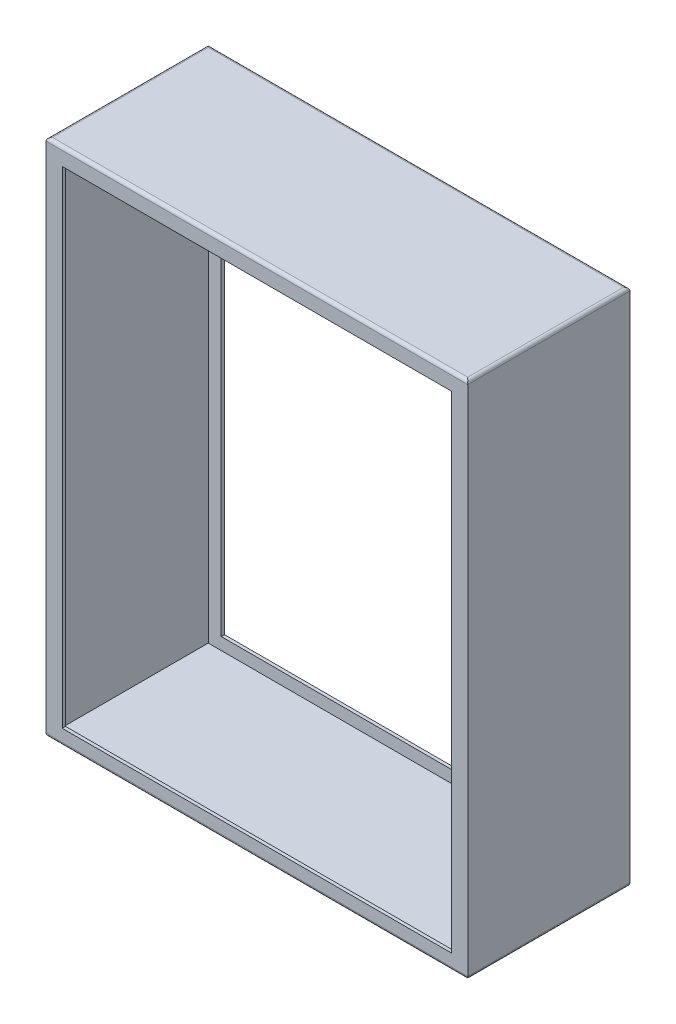
ISO-10303-21;
HEADER;
FILE_DESCRIPTION(('STEP AP214'),'2;1');
FILE_NAME('part.step','',(''),(''),'','','');
FILE_SCHEMA(('AUTOMOTIVE_DESIGN { 1 0 10303 214 1 1 1 1 }'));
ENDSEC;
DATA;
#1=APPLICATION_CONTEXT('core data for automotive mechanical design processes');
#2=APPLICATION_PROTOCOL_DEFINITION('international standard','automotive_design',2000,#1);
#3=PRODUCT_CONTEXT('',#1,'mechanical');
#4=PRODUCT('Part','Part','',(#3));
#5=PRODUCT_RELATED_PRODUCT_CATEGORY('part','',(#4));
#6=PRODUCT_DEFINITION_FORMATION('','',#4);
#7=PRODUCT_DEFINITION_CONTEXT('part definition',#1,'design');
#8=PRODUCT_DEFINITION('design','',#6,#7);
#9=PRODUCT_DEFINITION_SHAPE('','',#8);
#10=(LENGTH_UNIT() NAMED_UNIT(*) SI_UNIT(.MILLI.,.METRE.));
#11=(NAMED_UNIT(*) PLANE_ANGLE_UNIT() SI_UNIT($,.RADIAN.));
#12=(NAMED_UNIT(*) SI_UNIT($,.STERADIAN.) SOLID_ANGLE_UNIT());
#13=UNCERTAINTY_MEASURE_WITH_UNIT(LENGTH_MEASURE(1.E-05),#10,'distance_accuracy_value','');
#14=(GEOMETRIC_REPRESENTATION_CONTEXT(3) GLOBAL_UNCERTAINTY_ASSIGNED_CONTEXT((#13)) GLOBAL_UNIT_ASSIGNED_CONTEXT((#10,
#11,#12)) REPRESENTATION_CONTEXT('',''));
#15=CARTESIAN_POINT('',(0.,0.,0.));
#16=DIRECTION('',(0.,0.,1.));
#17=DIRECTION('',(1.,0.,0.));
#18=AXIS2_PLACEMENT_3D('',#15,#16,#17);
#19=CARTESIAN_POINT('',(317.5,393.065,0.));
#20=DIRECTION('',(1.,0.,0.));
#21=DIRECTION('',(0.,1.,0.));
#22=AXIS2_PLACEMENT_3D('',#19,#20,#21);
#23=PLANE('',#22);
#24=DIRECTION('',(0.,1.,0.));
#25=VECTOR('',#24,1.);
#26=CARTESIAN_POINT('',(317.5,393.065,124.46));
#27=LINE('',#26,#25);
#28=CARTESIAN_POINT('',(317.5,12.0649999999999,124.46));
#29=VERTEX_POINT('',#28);
#30=CARTESIAN_POINT('',(317.5,393.065,124.46));
#31=VERTEX_POINT('',#30);
#32=EDGE_CURVE('E56',#29,#31,#27,.T.);
#33=ORIENTED_EDGE('',*,*,#32,.F.);
#34=DIRECTION('',(0.,0.,1.));
#35=VECTOR('',#34,1.);
#36=CARTESIAN_POINT('',(317.5,12.0649999999999,0.));
#37=LINE('',#36,#35);
#38=CARTESIAN_POINT('',(317.5,12.0649999999999,127.));
#39=VERTEX_POINT('',#38);
#40=EDGE_CURVE('E265',#29,#39,#37,.T.);
#41=ORIENTED_EDGE('',*,*,#40,.T.);
#42=DIRECTION('',(0.,1.,0.));
#43=VECTOR('',#42,1.);
#44=CARTESIAN_POINT('',(317.5,393.065,127.));
#45=LINE('',#44,#43);
#46=CARTESIAN_POINT('',(317.5,393.065,127.));
#47=VERTEX_POINT('',#46);
#48=EDGE_CURVE('E216',#39,#47,#45,.T.);
#49=ORIENTED_EDGE('',*,*,#48,.T.);
#50=DIRECTION('',(0.,0.,1.));
#51=VECTOR('',#50,1.);
#52=CARTESIAN_POINT('',(317.5,393.065,0.));
#53=LINE('',#52,#51);
#54=EDGE_CURVE('E250',#31,#47,#53,.T.);
#55=ORIENTED_EDGE('',*,*,#54,.F.);
#56=EDGE_LOOP('',(#33,#41,#49,#55));
#57=FACE_BOUND('',#56,.T.);
#58=ADVANCED_FACE('F39',(#57),#23,.F.);
#59=CARTESIAN_POINT('',(12.7,12.0649999999999,0.));
#60=DIRECTION('',(0.,-1.,0.));
#61=DIRECTION('',(0.,0.,-1.));
#62=AXIS2_PLACEMENT_3D('',#59,#60,#61);
#63=PLANE('',#62);
#64=DIRECTION('',(1.,0.,0.));
#65=VECTOR('',#64,1.);
#66=CARTESIAN_POINT('',(12.7,12.0649999999999,124.46));
#67=LINE('',#66,#65);
#68=CARTESIAN_POINT('',(12.7,12.0649999999999,124.46));
#69=VERTEX_POINT('',#68);
#70=EDGE_CURVE('E228',#69,#29,#67,.T.);
#71=ORIENTED_EDGE('',*,*,#70,.F.);
#72=DIRECTION('',(0.,0.,1.));
#73=VECTOR('',#72,1.);
#74=CARTESIAN_POINT('',(12.7,12.0649999999999,0.));
#75=LINE('',#74,#73);
#76=CARTESIAN_POINT('',(12.7,12.0649999999999,127.));
#77=VERTEX_POINT('',#76);
#78=EDGE_CURVE('E269',#69,#77,#75,.T.);
#79=ORIENTED_EDGE('',*,*,#78,.T.);
#80=DIRECTION('',(1.,0.,0.));
#81=VECTOR('',#80,1.);
#82=CARTESIAN_POINT('',(12.7,12.0649999999999,127.));
#83=LINE('',#82,#81);
#84=EDGE_CURVE('E241',#77,#39,#83,.T.);
#85=ORIENTED_EDGE('',*,*,#84,.T.);
#86=ORIENTED_EDGE('',*,*,#40,.F.);
#87=EDGE_LOOP('',(#71,#79,#85,#86));
#88=FACE_BOUND('',#87,.T.);
#89=ADVANCED_FACE('F396',(#88),#63,.F.);
#90=CARTESIAN_POINT('',(12.6999999999999,393.065,0.));
#91=DIRECTION('',(-1.,0.,0.));
#92=DIRECTION('',(0.,-1.,0.));
#93=AXIS2_PLACEMENT_3D('',#90,#91,#92);
#94=PLANE('',#93);
#95=DIRECTION('',(0.,-1.,0.));
#96=VECTOR('',#95,1.);
#97=CARTESIAN_POINT('',(12.6999999999999,393.065,124.46));
#98=LINE('',#97,#96);
#99=CARTESIAN_POINT('',(12.6999999999999,393.065,124.46));
#100=VERTEX_POINT('',#99);
#101=EDGE_CURVE('E226',#100,#69,#98,.T.);
#102=ORIENTED_EDGE('',*,*,#101,.F.);
#103=DIRECTION('',(0.,0.,1.));
#104=VECTOR('',#103,1.);
#105=CARTESIAN_POINT('',(12.6999999999999,393.065,0.));
#106=LINE('',#105,#104);
#107=CARTESIAN_POINT('',(12.6999999999999,393.065,127.));
#108=VERTEX_POINT('',#107);
#109=EDGE_CURVE('E273',#100,#108,#106,.T.);
#110=ORIENTED_EDGE('',*,*,#109,.T.);
#111=DIRECTION('',(0.,-1.,0.));
#112=VECTOR('',#111,1.);
#113=CARTESIAN_POINT('',(12.6999999999999,393.065,127.));
#114=LINE('',#113,#112);
#115=EDGE_CURVE('E256',#108,#77,#114,.T.);
#116=ORIENTED_EDGE('',*,*,#115,.T.);
#117=ORIENTED_EDGE('',*,*,#78,.F.);
#118=EDGE_LOOP('',(#102,#110,#116,#117));
#119=FACE_BOUND('',#118,.T.);
#120=ADVANCED_FACE('F403',(#119),#94,.F.);
#121=CARTESIAN_POINT('',(12.6999999999999,393.065,0.));
#122=DIRECTION('',(0.,1.,0.));
#123=DIRECTION('',(0.,0.,1.));
#124=AXIS2_PLACEMENT_3D('',#121,#122,#123);
#125=PLANE('',#124);
#126=DIRECTION('',(-1.,0.,0.));
#127=VECTOR('',#126,1.);
#128=CARTESIAN_POINT('',(12.6999999999999,393.065,124.46));
#129=LINE('',#128,#127);
#130=EDGE_CURVE('E224',#31,#100,#129,.T.);
#131=ORIENTED_EDGE('',*,*,#130,.F.);
#132=ORIENTED_EDGE('',*,*,#54,.T.);
#133=DIRECTION('',(-1.,0.,0.));
#134=VECTOR('',#133,1.);
#135=CARTESIAN_POINT('',(12.6999999999999,393.065,127.));
#136=LINE('',#135,#134);
#137=EDGE_CURVE('E253',#47,#108,#136,.T.);
#138=ORIENTED_EDGE('',*,*,#137,.T.);
#139=ORIENTED_EDGE('',*,*,#109,.F.);
#140=EDGE_LOOP('',(#131,#132,#138,#139));
#141=FACE_BOUND('',#140,.T.);
#142=ADVANCED_FACE('F428',(#141),#125,.F.);
#143=CARTESIAN_POINT('',(0.,0.,127.));
#144=DIRECTION('',(1.,0.,0.));
#145=DIRECTION('',(0.,0.,-1.));
#146=AXIS2_PLACEMENT_3D('',#143,#144,#145);
#147=PLANE('',#146);
#148=DIRECTION('',(0.,-1.,0.));
#149=VECTOR('',#148,1.);
#150=CARTESIAN_POINT('',(0.,0.,0.));
#151=LINE('',#150,#149);
#152=CARTESIAN_POINT('',(0.,403.86,0.));
#153=VERTEX_POINT('',#152);
#154=CARTESIAN_POINT('',(0.,2.54,0.));
#155=VERTEX_POINT('',#154);
#156=EDGE_CURVE('E284',#153,#155,#151,.T.);
#157=ORIENTED_EDGE('',*,*,#156,.T.);
#158=DIRECTION('',(0.,0.,-1.));
#159=VECTOR('',#158,1.);
#160=CARTESIAN_POINT('',(0.,2.54,127.));
#161=LINE('',#160,#159);
#162=CARTESIAN_POINT('',(0.,2.54,127.));
#163=VERTEX_POINT('',#162);
#164=EDGE_CURVE('E326',#155,#163,#161,.F.);
#165=ORIENTED_EDGE('',*,*,#164,.T.);
#166=DIRECTION('',(0.,-1.,0.));
#167=VECTOR('',#166,1.);
#168=CARTESIAN_POINT('',(0.,0.,127.));
#169=LINE('',#168,#167);
#170=CARTESIAN_POINT('',(0.,403.86,127.));
#171=VERTEX_POINT('',#170);
#172=EDGE_CURVE('E277',#171,#163,#169,.T.);
#173=ORIENTED_EDGE('',*,*,#172,.F.);
#174=DIRECTION('',(0.,0.,-1.));
#175=VECTOR('',#174,1.);
#176=CARTESIAN_POINT('',(0.,403.86,127.));
#177=LINE('',#176,#175);
#178=EDGE_CURVE('E302',#171,#153,#177,.T.);
#179=ORIENTED_EDGE('',*,*,#178,.T.);
#180=EDGE_LOOP('',(#157,#165,#173,#179));
#181=FACE_BOUND('',#180,.T.);
#182=ADVANCED_FACE('F381',(#181),#147,.F.);
#183=CARTESIAN_POINT('',(0.,0.,127.));
#184=DIRECTION('',(0.,1.,0.));
#185=DIRECTION('',(0.,0.,1.));
#186=AXIS2_PLACEMENT_3D('',#183,#184,#185);
#187=PLANE('',#186);
#188=DIRECTION('',(1.,0.,0.));
#189=VECTOR('',#188,1.);
#190=CARTESIAN_POINT('',(0.,0.,124.46));
#191=LINE('',#190,#189);
#192=CARTESIAN_POINT('',(327.66,0.,124.46));
#193=VERTEX_POINT('',#192);
#194=CARTESIAN_POINT('',(2.54,0.,124.46));
#195=VERTEX_POINT('',#194);
#196=EDGE_CURVE('E321',#193,#195,#191,.F.);
#197=ORIENTED_EDGE('',*,*,#196,.T.);
#198=DIRECTION('',(0.,0.,-1.));
#199=VECTOR('',#198,1.);
#200=CARTESIAN_POINT('',(2.54,0.,127.));
#201=LINE('',#200,#199);
#202=CARTESIAN_POINT('',(2.54,0.,2.54));
#203=VERTEX_POINT('',#202);
#204=EDGE_CURVE('E323',#195,#203,#201,.T.);
#205=ORIENTED_EDGE('',*,*,#204,.T.);
#206=DIRECTION('',(1.,0.,0.));
#207=VECTOR('',#206,1.);
#208=CARTESIAN_POINT('',(330.2,0.,2.54));
#209=LINE('',#208,#207);
#210=CARTESIAN_POINT('',(327.66,0.,2.54));
#211=VERTEX_POINT('',#210);
#212=EDGE_CURVE('E307',#203,#211,#209,.T.);
#213=ORIENTED_EDGE('',*,*,#212,.T.);
#214=DIRECTION('',(0.,0.,-1.));
#215=VECTOR('',#214,1.);
#216=CARTESIAN_POINT('',(327.66,0.,127.));
#217=LINE('',#216,#215);
#218=EDGE_CURVE('E319',#211,#193,#217,.F.);
#219=ORIENTED_EDGE('',*,*,#218,.T.);
#220=EDGE_LOOP('',(#197,#205,#213,#219));
#221=FACE_BOUND('',#220,.T.);
#222=ADVANCED_FACE('F441',(#221),#187,.F.);
#223=CARTESIAN_POINT('',(330.2,0.,127.));
#224=DIRECTION('',(-1.,0.,0.));
#225=DIRECTION('',(0.,0.,1.));
#226=AXIS2_PLACEMENT_3D('',#223,#224,#225);
#227=PLANE('',#226);
#228=DIRECTION('',(0.,1.,0.));
#229=VECTOR('',#228,1.);
#230=CARTESIAN_POINT('',(330.2,0.,127.));
#231=LINE('',#230,#229);
#232=CARTESIAN_POINT('',(330.2,2.54,127.));
#233=VERTEX_POINT('',#232);
#234=CARTESIAN_POINT('',(330.2,403.86,127.));
#235=VERTEX_POINT('',#234);
#236=EDGE_CURVE('E280',#233,#235,#231,.T.);
#237=ORIENTED_EDGE('',*,*,#236,.F.);
#238=DIRECTION('',(0.,0.,-1.));
#239=VECTOR('',#238,1.);
#240=CARTESIAN_POINT('',(330.2,2.54,127.));
#241=LINE('',#240,#239);
#242=CARTESIAN_POINT('',(330.2,2.54,0.));
#243=VERTEX_POINT('',#242);
#244=EDGE_CURVE('E48',#233,#243,#241,.T.);
#245=ORIENTED_EDGE('',*,*,#244,.T.);
#246=DIRECTION('',(0.,1.,0.));
#247=VECTOR('',#246,1.);
#248=CARTESIAN_POINT('',(330.2,0.,0.));
#249=LINE('',#248,#247);
#250=CARTESIAN_POINT('',(330.2,403.86,0.));
#251=VERTEX_POINT('',#250);
#252=EDGE_CURVE('E281',#243,#251,#249,.T.);
#253=ORIENTED_EDGE('',*,*,#252,.T.);
#254=DIRECTION('',(0.,0.,-1.));
#255=VECTOR('',#254,1.);
#256=CARTESIAN_POINT('',(330.2,403.86,127.));
#257=LINE('',#256,#255);
#258=EDGE_CURVE('E297',#251,#235,#257,.F.);
#259=ORIENTED_EDGE('',*,*,#258,.T.);
#260=EDGE_LOOP('',(#237,#245,#253,#259));
#261=FACE_BOUND('',#260,.T.);
#262=ADVANCED_FACE('F353',(#261),#227,.F.);
#263=CARTESIAN_POINT('',(0.,406.4,127.));
#264=DIRECTION('',(0.,-1.,0.));
#265=DIRECTION('',(0.,0.,-1.));
#266=AXIS2_PLACEMENT_3D('',#263,#264,#265);
#267=PLANE('',#266);
#268=DIRECTION('',(-1.,0.,0.));
#269=VECTOR('',#268,1.);
#270=CARTESIAN_POINT('',(0.,406.4,124.46));
#271=LINE('',#270,#269);
#272=CARTESIAN_POINT('',(2.54,406.4,124.46));
#273=VERTEX_POINT('',#272);
#274=CARTESIAN_POINT('',(327.66,406.4,124.46));
#275=VERTEX_POINT('',#274);
#276=EDGE_CURVE('E292',#273,#275,#271,.F.);
#277=ORIENTED_EDGE('',*,*,#276,.T.);
#278=DIRECTION('',(0.,0.,-1.));
#279=VECTOR('',#278,1.);
#280=CARTESIAN_POINT('',(327.66,406.4,127.));
#281=LINE('',#280,#279);
#282=CARTESIAN_POINT('',(327.66,406.4,2.54));
#283=VERTEX_POINT('',#282);
#284=EDGE_CURVE('E294',#275,#283,#281,.T.);
#285=ORIENTED_EDGE('',*,*,#284,.T.);
#286=DIRECTION('',(-1.,0.,0.));
#287=VECTOR('',#286,1.);
#288=CARTESIAN_POINT('',(0.,406.4,2.54));
#289=LINE('',#288,#287);
#290=CARTESIAN_POINT('',(2.54,406.4,2.54));
#291=VERTEX_POINT('',#290);
#292=EDGE_CURVE('E283',#283,#291,#289,.T.);
#293=ORIENTED_EDGE('',*,*,#292,.T.);
#294=DIRECTION('',(0.,0.,-1.));
#295=VECTOR('',#294,1.);
#296=CARTESIAN_POINT('',(2.54,406.4,127.));
#297=LINE('',#296,#295);
#298=EDGE_CURVE('E290',#291,#273,#297,.F.);
#299=ORIENTED_EDGE('',*,*,#298,.T.);
#300=EDGE_LOOP('',(#277,#285,#293,#299));
#301=FACE_BOUND('',#300,.T.);
#302=ADVANCED_FACE('F371',(#301),#267,.F.);
#303=CARTESIAN_POINT('',(0.,0.,127.));
#304=DIRECTION('',(0.,0.,-1.));
#305=DIRECTION('',(-1.,0.,0.));
#306=AXIS2_PLACEMENT_3D('',#303,#304,#305);
#307=PLANE('',#306);
#308=ORIENTED_EDGE('',*,*,#137,.F.);
#309=ORIENTED_EDGE('',*,*,#48,.F.);
#310=ORIENTED_EDGE('',*,*,#84,.F.);
#311=ORIENTED_EDGE('',*,*,#115,.F.);
#312=EDGE_LOOP('',(#308,#309,#310,#311));
#313=FACE_BOUND('',#312,.T.);
#314=ORIENTED_EDGE('',*,*,#172,.T.);
#315=DIRECTION('',(1.,0.,0.));
#316=VECTOR('',#315,1.);
#317=CARTESIAN_POINT('',(0.,2.54,127.));
#318=LINE('',#317,#316);
#319=EDGE_CURVE('E329',#163,#233,#318,.T.);
#320=ORIENTED_EDGE('',*,*,#319,.T.);
#321=ORIENTED_EDGE('',*,*,#236,.T.);
#322=DIRECTION('',(-1.,0.,0.));
#323=VECTOR('',#322,1.);
#324=CARTESIAN_POINT('',(0.,403.86,127.));
#325=LINE('',#324,#323);
#326=EDGE_CURVE('E300',#235,#171,#325,.T.);
#327=ORIENTED_EDGE('',*,*,#326,.T.);
#328=EDGE_LOOP('',(#314,#320,#321,#327));
#329=FACE_BOUND('',#328,.T.);
#330=ADVANCED_FACE('F378',(#313,#329),#307,.F.);
#331=CARTESIAN_POINT('',(0.,0.,0.));
#332=DIRECTION('',(0.,0.,-1.));
#333=DIRECTION('',(-1.,0.,0.));
#334=AXIS2_PLACEMENT_3D('',#331,#332,#333);
#335=PLANE('',#334);
#336=DIRECTION('',(0.,1.,0.));
#337=VECTOR('',#336,1.);
#338=CARTESIAN_POINT('',(317.5,393.065,0.));
#339=LINE('',#338,#337);
#340=CARTESIAN_POINT('',(317.5,12.0649999999999,0.));
#341=VERTEX_POINT('',#340);
#342=CARTESIAN_POINT('',(317.5,393.065,0.));
#343=VERTEX_POINT('',#342);
#344=EDGE_CURVE('E237',#341,#343,#339,.T.);
#345=ORIENTED_EDGE('',*,*,#344,.T.);
#346=DIRECTION('',(-1.,0.,0.));
#347=VECTOR('',#346,1.);
#348=CARTESIAN_POINT('',(12.6999999999999,393.065,0.));
#349=LINE('',#348,#347);
#350=CARTESIAN_POINT('',(12.6999999999999,393.065,0.));
#351=VERTEX_POINT('',#350);
#352=EDGE_CURVE('E240',#343,#351,#349,.T.);
#353=ORIENTED_EDGE('',*,*,#352,.T.);
#354=DIRECTION('',(0.,-1.,0.));
#355=VECTOR('',#354,1.);
#356=CARTESIAN_POINT('',(12.6999999999999,393.065,0.));
#357=LINE('',#356,#355);
#358=CARTESIAN_POINT('',(12.7,12.0649999999999,0.));
#359=VERTEX_POINT('',#358);
#360=EDGE_CURVE('E244',#351,#359,#357,.T.);
#361=ORIENTED_EDGE('',*,*,#360,.T.);
#362=DIRECTION('',(1.,0.,0.));
#363=VECTOR('',#362,1.);
#364=CARTESIAN_POINT('',(12.7,12.0649999999999,0.));
#365=LINE('',#364,#363);
#366=EDGE_CURVE('E247',#359,#341,#365,.T.);
#367=ORIENTED_EDGE('',*,*,#366,.T.);
#368=EDGE_LOOP('',(#345,#353,#361,#367));
#369=FACE_BOUND('',#368,.T.);
#370=ORIENTED_EDGE('',*,*,#252,.F.);
#371=DIRECTION('',(1.,0.,0.));
#372=VECTOR('',#371,1.);
#373=CARTESIAN_POINT('',(0.,2.54,0.));
#374=LINE('',#373,#372);
#375=EDGE_CURVE('E11',#243,#155,#374,.F.);
#376=ORIENTED_EDGE('',*,*,#375,.T.);
#377=ORIENTED_EDGE('',*,*,#156,.F.);
#378=DIRECTION('',(-1.,0.,0.));
#379=VECTOR('',#378,1.);
#380=CARTESIAN_POINT('',(330.2,403.86,0.));
#381=LINE('',#380,#379);
#382=EDGE_CURVE('E304',#153,#251,#381,.F.);
#383=ORIENTED_EDGE('',*,*,#382,.T.);
#384=EDGE_LOOP('',(#370,#376,#377,#383));
#385=FACE_BOUND('',#384,.T.);
#386=ADVANCED_FACE('F355',(#369,#385),#335,.T.);
#387=CARTESIAN_POINT('',(2.54,403.86,127.));
#388=DIRECTION('',(0.,0.,-1.));
#389=DIRECTION('',(-1.,0.,0.));
#390=AXIS2_PLACEMENT_3D('',#387,#388,#389);
#391=CYLINDRICAL_SURFACE('',#390,2.54);
#392=CARTESIAN_POINT('',(2.54,403.86,2.54));
#393=DIRECTION('',(0.707106781186547,0.,-0.707106781186547));
#394=DIRECTION('',(0.707106781186547,0.,0.707106781186547));
#395=AXIS2_PLACEMENT_3D('',#392,#393,#394);
#396=ELLIPSE('',#395,3.59210244842766,2.54);
#397=EDGE_CURVE('E313',#153,#291,#396,.T.);
#398=ORIENTED_EDGE('',*,*,#397,.F.);
#399=ORIENTED_EDGE('',*,*,#178,.F.);
#400=CARTESIAN_POINT('',(2.54,403.86,124.46));
#401=DIRECTION('',(-0.707106781186547,0.,-0.707106781186547));
#402=DIRECTION('',(0.707106781186547,0.,-0.707106781186547));
#403=AXIS2_PLACEMENT_3D('',#400,#401,#402);
#404=ELLIPSE('',#403,3.59210244842766,2.54);
#405=EDGE_CURVE('E287',#273,#171,#404,.F.);
#406=ORIENTED_EDGE('',*,*,#405,.F.);
#407=ORIENTED_EDGE('',*,*,#298,.F.);
#408=EDGE_LOOP('',(#398,#399,#406,#407));
#409=FACE_BOUND('',#408,.T.);
#410=ADVANCED_FACE('F384',(#409),#391,.T.);
#411=CARTESIAN_POINT('',(0.,403.86,124.46));
#412=DIRECTION('',(-1.,0.,0.));
#413=DIRECTION('',(0.,0.,1.));
#414=AXIS2_PLACEMENT_3D('',#411,#412,#413);
#415=CYLINDRICAL_SURFACE('',#414,2.54);
#416=ORIENTED_EDGE('',*,*,#405,.T.);
#417=ORIENTED_EDGE('',*,*,#326,.F.);
#418=CARTESIAN_POINT('',(327.66,403.86,124.46));
#419=DIRECTION('',(-0.707106781186547,0.,0.707106781186547));
#420=DIRECTION('',(-0.707106781186547,0.,-0.707106781186547));
#421=AXIS2_PLACEMENT_3D('',#418,#419,#420);
#422=ELLIPSE('',#421,3.59210244842766,2.54);
#423=EDGE_CURVE('E310',#275,#235,#422,.F.);
#424=ORIENTED_EDGE('',*,*,#423,.F.);
#425=ORIENTED_EDGE('',*,*,#276,.F.);
#426=EDGE_LOOP('',(#416,#417,#424,#425));
#427=FACE_BOUND('',#426,.T.);
#428=ADVANCED_FACE('F375',(#427),#415,.T.);
#429=CARTESIAN_POINT('',(0.,403.86,2.54));
#430=DIRECTION('',(1.,0.,0.));
#431=DIRECTION('',(0.,0.,-1.));
#432=AXIS2_PLACEMENT_3D('',#429,#430,#431);
#433=CYLINDRICAL_SURFACE('',#432,2.54);
#434=ORIENTED_EDGE('',*,*,#397,.T.);
#435=ORIENTED_EDGE('',*,*,#292,.F.);
#436=CARTESIAN_POINT('',(327.66,403.86,2.54));
#437=DIRECTION('',(0.707106781186547,0.,0.707106781186547));
#438=DIRECTION('',(0.707106781186547,0.,-0.707106781186547));
#439=AXIS2_PLACEMENT_3D('',#436,#437,#438);
#440=ELLIPSE('',#439,3.59210244842766,2.54);
#441=EDGE_CURVE('E308',#251,#283,#440,.T.);
#442=ORIENTED_EDGE('',*,*,#441,.F.);
#443=ORIENTED_EDGE('',*,*,#382,.F.);
#444=EDGE_LOOP('',(#434,#435,#442,#443));
#445=FACE_BOUND('',#444,.T.);
#446=ADVANCED_FACE('F368',(#445),#433,.T.);
#447=CARTESIAN_POINT('',(327.66,403.86,127.));
#448=DIRECTION('',(0.,0.,-1.));
#449=DIRECTION('',(-1.,0.,0.));
#450=AXIS2_PLACEMENT_3D('',#447,#448,#449);
#451=CYLINDRICAL_SURFACE('',#450,2.54);
#452=ORIENTED_EDGE('',*,*,#423,.T.);
#453=ORIENTED_EDGE('',*,*,#258,.F.);
#454=ORIENTED_EDGE('',*,*,#441,.T.);
#455=ORIENTED_EDGE('',*,*,#284,.F.);
#456=EDGE_LOOP('',(#452,#453,#454,#455));
#457=FACE_BOUND('',#456,.T.);
#458=ADVANCED_FACE('F363',(#457),#451,.T.);
#459=CARTESIAN_POINT('',(327.66,2.54,127.));
#460=DIRECTION('',(0.,0.,-1.));
#461=DIRECTION('',(-1.,0.,0.));
#462=AXIS2_PLACEMENT_3D('',#459,#460,#461);
#463=CYLINDRICAL_SURFACE('',#462,2.54);
#464=CARTESIAN_POINT('',(327.66,2.54,2.54));
#465=DIRECTION('',(-0.707106781186547,0.,-0.707106781186547));
#466=DIRECTION('',(-0.707106781186547,0.,0.707106781186547));
#467=AXIS2_PLACEMENT_3D('',#464,#465,#466);
#468=ELLIPSE('',#467,3.59210244842766,2.54);
#469=EDGE_CURVE('E334',#243,#211,#468,.T.);
#470=ORIENTED_EDGE('',*,*,#469,.F.);
#471=ORIENTED_EDGE('',*,*,#244,.F.);
#472=CARTESIAN_POINT('',(327.66,2.54,124.46));
#473=DIRECTION('',(0.707106781186547,0.,-0.707106781186547));
#474=DIRECTION('',(-0.707106781186547,0.,-0.707106781186547));
#475=AXIS2_PLACEMENT_3D('',#472,#473,#474);
#476=ELLIPSE('',#475,3.59210244842766,2.54);
#477=EDGE_CURVE('E43',#193,#233,#476,.F.);
#478=ORIENTED_EDGE('',*,*,#477,.F.);
#479=ORIENTED_EDGE('',*,*,#218,.F.);
#480=EDGE_LOOP('',(#470,#471,#478,#479));
#481=FACE_BOUND('',#480,.T.);
#482=ADVANCED_FACE('F41',(#481),#463,.T.);
#483=CARTESIAN_POINT('',(0.,2.54,124.46));
#484=DIRECTION('',(1.,0.,0.));
#485=DIRECTION('',(0.,0.,-1.));
#486=AXIS2_PLACEMENT_3D('',#483,#484,#485);
#487=CYLINDRICAL_SURFACE('',#486,2.54);
#488=ORIENTED_EDGE('',*,*,#477,.T.);
#489=ORIENTED_EDGE('',*,*,#319,.F.);
#490=CARTESIAN_POINT('',(2.54,2.54,124.46));
#491=DIRECTION('',(0.707106781186547,0.,0.707106781186547));
#492=DIRECTION('',(0.707106781186547,0.,-0.707106781186547));
#493=AXIS2_PLACEMENT_3D('',#490,#491,#492);
#494=ELLIPSE('',#493,3.59210244842766,2.54);
#495=EDGE_CURVE('E333',#195,#163,#494,.F.);
#496=ORIENTED_EDGE('',*,*,#495,.F.);
#497=ORIENTED_EDGE('',*,*,#196,.F.);
#498=EDGE_LOOP('',(#488,#489,#496,#497));
#499=FACE_BOUND('',#498,.T.);
#500=ADVANCED_FACE('F345',(#499),#487,.T.);
#501=CARTESIAN_POINT('',(0.,2.54,2.54));
#502=DIRECTION('',(-1.,0.,0.));
#503=DIRECTION('',(0.,0.,1.));
#504=AXIS2_PLACEMENT_3D('',#501,#502,#503);
#505=CYLINDRICAL_SURFACE('',#504,2.54);
#506=ORIENTED_EDGE('',*,*,#469,.T.);
#507=ORIENTED_EDGE('',*,*,#212,.F.);
#508=CARTESIAN_POINT('',(2.54,2.54,2.54));
#509=DIRECTION('',(-0.707106781186547,0.,0.707106781186547));
#510=DIRECTION('',(-0.707106781186547,0.,-0.707106781186547));
#511=AXIS2_PLACEMENT_3D('',#508,#509,#510);
#512=ELLIPSE('',#511,3.59210244842766,2.54);
#513=EDGE_CURVE('E264',#155,#203,#512,.T.);
#514=ORIENTED_EDGE('',*,*,#513,.F.);
#515=ORIENTED_EDGE('',*,*,#375,.F.);
#516=EDGE_LOOP('',(#506,#507,#514,#515));
#517=FACE_BOUND('',#516,.T.);
#518=ADVANCED_FACE('F418',(#517),#505,.T.);
#519=CARTESIAN_POINT('',(2.54,2.54,127.));
#520=DIRECTION('',(0.,0.,-1.));
#521=DIRECTION('',(-1.,0.,0.));
#522=AXIS2_PLACEMENT_3D('',#519,#520,#521);
#523=CYLINDRICAL_SURFACE('',#522,2.54);
#524=ORIENTED_EDGE('',*,*,#495,.T.);
#525=ORIENTED_EDGE('',*,*,#164,.F.);
#526=ORIENTED_EDGE('',*,*,#513,.T.);
#527=ORIENTED_EDGE('',*,*,#204,.F.);
#528=EDGE_LOOP('',(#524,#525,#526,#527));
#529=FACE_BOUND('',#528,.T.);
#530=ADVANCED_FACE('F410',(#529),#523,.T.);
#531=CARTESIAN_POINT('',(317.5,12.0649999999999,2.54));
#532=VERTEX_POINT('',#531);
#533=EDGE_CURVE('E261',#341,#532,#37,.T.);
#534=ORIENTED_EDGE('',*,*,#533,.T.);
#535=DIRECTION('',(0.,1.,0.));
#536=VECTOR('',#535,1.);
#537=CARTESIAN_POINT('',(317.5,393.065,2.54));
#538=LINE('',#537,#536);
#539=CARTESIAN_POINT('',(317.5,393.065,2.54));
#540=VERTEX_POINT('',#539);
#541=EDGE_CURVE('E230',#532,#540,#538,.T.);
#542=ORIENTED_EDGE('',*,*,#541,.T.);
#543=EDGE_CURVE('E274',#343,#540,#53,.T.);
#544=ORIENTED_EDGE('',*,*,#543,.F.);
#545=ORIENTED_EDGE('',*,*,#344,.F.);
#546=EDGE_LOOP('',(#534,#542,#544,#545));
#547=FACE_BOUND('',#546,.T.);
#548=ADVANCED_FACE('F399',(#547),#23,.F.);
#549=CARTESIAN_POINT('',(12.7,12.0649999999999,2.54));
#550=VERTEX_POINT('',#549);
#551=EDGE_CURVE('E266',#359,#550,#75,.T.);
#552=ORIENTED_EDGE('',*,*,#551,.T.);
#553=DIRECTION('',(1.,0.,0.));
#554=VECTOR('',#553,1.);
#555=CARTESIAN_POINT('',(12.7,12.0649999999999,2.54));
#556=LINE('',#555,#554);
#557=EDGE_CURVE('E204',#550,#532,#556,.T.);
#558=ORIENTED_EDGE('',*,*,#557,.T.);
#559=ORIENTED_EDGE('',*,*,#533,.F.);
#560=ORIENTED_EDGE('',*,*,#366,.F.);
#561=EDGE_LOOP('',(#552,#558,#559,#560));
#562=FACE_BOUND('',#561,.T.);
#563=ADVANCED_FACE('F406',(#562),#63,.F.);
#564=CARTESIAN_POINT('',(12.6999999999999,393.065,2.54));
#565=VERTEX_POINT('',#564);
#566=EDGE_CURVE('E270',#351,#565,#106,.T.);
#567=ORIENTED_EDGE('',*,*,#566,.T.);
#568=DIRECTION('',(0.,-1.,0.));
#569=VECTOR('',#568,1.);
#570=CARTESIAN_POINT('',(12.6999999999999,393.065,2.54));
#571=LINE('',#570,#569);
#572=EDGE_CURVE('E64',#565,#550,#571,.T.);
#573=ORIENTED_EDGE('',*,*,#572,.T.);
#574=ORIENTED_EDGE('',*,*,#551,.F.);
#575=ORIENTED_EDGE('',*,*,#360,.F.);
#576=EDGE_LOOP('',(#567,#573,#574,#575));
#577=FACE_BOUND('',#576,.T.);
#578=ADVANCED_FACE('F416',(#577),#94,.F.);
#579=ORIENTED_EDGE('',*,*,#543,.T.);
#580=DIRECTION('',(-1.,0.,0.));
#581=VECTOR('',#580,1.);
#582=CARTESIAN_POINT('',(12.6999999999999,393.065,2.54));
#583=LINE('',#582,#581);
#584=EDGE_CURVE('E233',#540,#565,#583,.T.);
#585=ORIENTED_EDGE('',*,*,#584,.T.);
#586=ORIENTED_EDGE('',*,*,#566,.F.);
#587=ORIENTED_EDGE('',*,*,#352,.F.);
#588=EDGE_LOOP('',(#579,#585,#586,#587));
#589=FACE_BOUND('',#588,.T.);
#590=ADVANCED_FACE('F426',(#589),#125,.F.);
#591=CARTESIAN_POINT('',(2.54,0.,127.));
#592=DIRECTION('',(1.,0.,0.));
#593=DIRECTION('',(0.,0.,-1.));
#594=AXIS2_PLACEMENT_3D('',#591,#592,#593);
#595=PLANE('',#594);
#596=DIRECTION('',(0.,-1.,0.));
#597=VECTOR('',#596,1.);
#598=CARTESIAN_POINT('',(2.54,0.,2.54));
#599=LINE('',#598,#597);
#600=CARTESIAN_POINT('',(2.54,403.86,2.54));
#601=VERTEX_POINT('',#600);
#602=CARTESIAN_POINT('',(2.54,2.54,2.54));
#603=VERTEX_POINT('',#602);
#604=EDGE_CURVE('E182',#601,#603,#599,.T.);
#605=ORIENTED_EDGE('',*,*,#604,.F.);
#606=DIRECTION('',(0.,0.,-1.));
#607=VECTOR('',#606,1.);
#608=CARTESIAN_POINT('',(2.54,403.86,127.));
#609=LINE('',#608,#607);
#610=CARTESIAN_POINT('',(2.54,403.86,124.46));
#611=VERTEX_POINT('',#610);
#612=EDGE_CURVE('E197',#611,#601,#609,.T.);
#613=ORIENTED_EDGE('',*,*,#612,.F.);
#614=DIRECTION('',(0.,-1.,0.));
#615=VECTOR('',#614,1.);
#616=CARTESIAN_POINT('',(2.54,0.,124.46));
#617=LINE('',#616,#615);
#618=CARTESIAN_POINT('',(2.54,2.54,124.46));
#619=VERTEX_POINT('',#618);
#620=EDGE_CURVE('E183',#611,#619,#617,.T.);
#621=ORIENTED_EDGE('',*,*,#620,.T.);
#622=DIRECTION('',(0.,0.,1.));
#623=VECTOR('',#622,1.);
#624=CARTESIAN_POINT('',(2.54,2.54,127.));
#625=LINE('',#624,#623);
#626=EDGE_CURVE('E177',#603,#619,#625,.T.);
#627=ORIENTED_EDGE('',*,*,#626,.F.);
#628=EDGE_LOOP('',(#605,#613,#621,#627));
#629=FACE_BOUND('',#628,.T.);
#630=ADVANCED_FACE('F179',(#629),#595,.T.);
#631=CARTESIAN_POINT('',(0.,2.54,127.));
#632=DIRECTION('',(0.,1.,0.));
#633=DIRECTION('',(0.,0.,1.));
#634=AXIS2_PLACEMENT_3D('',#631,#632,#633);
#635=PLANE('',#634);
#636=DIRECTION('',(1.,0.,0.));
#637=VECTOR('',#636,1.);
#638=CARTESIAN_POINT('',(0.,2.54,124.46));
#639=LINE('',#638,#637);
#640=CARTESIAN_POINT('',(327.66,2.54,124.46));
#641=VERTEX_POINT('',#640);
#642=EDGE_CURVE('E187',#619,#641,#639,.T.);
#643=ORIENTED_EDGE('',*,*,#642,.T.);
#644=DIRECTION('',(0.,0.,-1.));
#645=VECTOR('',#644,1.);
#646=CARTESIAN_POINT('',(327.66,2.54,127.));
#647=LINE('',#646,#645);
#648=CARTESIAN_POINT('',(327.66,2.54,2.54));
#649=VERTEX_POINT('',#648);
#650=EDGE_CURVE('E193',#641,#649,#647,.T.);
#651=ORIENTED_EDGE('',*,*,#650,.T.);
#652=DIRECTION('',(1.,0.,0.));
#653=VECTOR('',#652,1.);
#654=CARTESIAN_POINT('',(0.,2.54,2.54));
#655=LINE('',#654,#653);
#656=EDGE_CURVE('E188',#603,#649,#655,.T.);
#657=ORIENTED_EDGE('',*,*,#656,.F.);
#658=ORIENTED_EDGE('',*,*,#626,.T.);
#659=EDGE_LOOP('',(#643,#651,#657,#658));
#660=FACE_BOUND('',#659,.T.);
#661=ADVANCED_FACE('F191',(#660),#635,.T.);
#662=CARTESIAN_POINT('',(327.66,0.,127.));
#663=DIRECTION('',(-1.,0.,0.));
#664=DIRECTION('',(0.,0.,1.));
#665=AXIS2_PLACEMENT_3D('',#662,#663,#664);
#666=PLANE('',#665);
#667=DIRECTION('',(0.,1.,0.));
#668=VECTOR('',#667,1.);
#669=CARTESIAN_POINT('',(327.66,0.,124.46));
#670=LINE('',#669,#668);
#671=CARTESIAN_POINT('',(327.66,403.86,124.46));
#672=VERTEX_POINT('',#671);
#673=EDGE_CURVE('E211',#641,#672,#670,.T.);
#674=ORIENTED_EDGE('',*,*,#673,.T.);
#675=DIRECTION('',(0.,0.,1.));
#676=VECTOR('',#675,1.);
#677=CARTESIAN_POINT('',(327.66,403.86,127.));
#678=LINE('',#677,#676);
#679=CARTESIAN_POINT('',(327.66,403.86,2.54));
#680=VERTEX_POINT('',#679);
#681=EDGE_CURVE('E219',#680,#672,#678,.T.);
#682=ORIENTED_EDGE('',*,*,#681,.F.);
#683=DIRECTION('',(0.,1.,0.));
#684=VECTOR('',#683,1.);
#685=CARTESIAN_POINT('',(327.66,0.,2.54));
#686=LINE('',#685,#684);
#687=EDGE_CURVE('E203',#649,#680,#686,.T.);
#688=ORIENTED_EDGE('',*,*,#687,.F.);
#689=ORIENTED_EDGE('',*,*,#650,.F.);
#690=EDGE_LOOP('',(#674,#682,#688,#689));
#691=FACE_BOUND('',#690,.T.);
#692=ADVANCED_FACE('F463',(#691),#666,.T.);
#693=CARTESIAN_POINT('',(0.,403.86,127.));
#694=DIRECTION('',(0.,-1.,0.));
#695=DIRECTION('',(0.,0.,-1.));
#696=AXIS2_PLACEMENT_3D('',#693,#694,#695);
#697=PLANE('',#696);
#698=DIRECTION('',(-1.,0.,0.));
#699=VECTOR('',#698,1.);
#700=CARTESIAN_POINT('',(0.,403.86,124.46));
#701=LINE('',#700,#699);
#702=EDGE_CURVE('E213',#672,#611,#701,.T.);
#703=ORIENTED_EDGE('',*,*,#702,.T.);
#704=ORIENTED_EDGE('',*,*,#612,.T.);
#705=DIRECTION('',(-1.,0.,0.));
#706=VECTOR('',#705,1.);
#707=CARTESIAN_POINT('',(0.,403.86,2.54));
#708=LINE('',#707,#706);
#709=EDGE_CURVE('E201',#680,#601,#708,.T.);
#710=ORIENTED_EDGE('',*,*,#709,.F.);
#711=ORIENTED_EDGE('',*,*,#681,.T.);
#712=EDGE_LOOP('',(#703,#704,#710,#711));
#713=FACE_BOUND('',#712,.T.);
#714=ADVANCED_FACE('F458',(#713),#697,.T.);
#715=CARTESIAN_POINT('',(0.,0.,124.46));
#716=DIRECTION('',(0.,0.,-1.));
#717=DIRECTION('',(-1.,0.,0.));
#718=AXIS2_PLACEMENT_3D('',#715,#716,#717);
#719=PLANE('',#718);
#720=ORIENTED_EDGE('',*,*,#130,.T.);
#721=ORIENTED_EDGE('',*,*,#101,.T.);
#722=ORIENTED_EDGE('',*,*,#70,.T.);
#723=ORIENTED_EDGE('',*,*,#32,.T.);
#724=EDGE_LOOP('',(#720,#721,#722,#723));
#725=FACE_BOUND('',#724,.T.);
#726=ORIENTED_EDGE('',*,*,#620,.F.);
#727=ORIENTED_EDGE('',*,*,#702,.F.);
#728=ORIENTED_EDGE('',*,*,#673,.F.);
#729=ORIENTED_EDGE('',*,*,#642,.F.);
#730=EDGE_LOOP('',(#726,#727,#728,#729));
#731=FACE_BOUND('',#730,.T.);
#732=ADVANCED_FACE('F455',(#725,#731),#719,.T.);
#733=CARTESIAN_POINT('',(0.,0.,2.54));
#734=DIRECTION('',(0.,0.,-1.));
#735=DIRECTION('',(-1.,0.,0.));
#736=AXIS2_PLACEMENT_3D('',#733,#734,#735);
#737=PLANE('',#736);
#738=ORIENTED_EDGE('',*,*,#541,.F.);
#739=ORIENTED_EDGE('',*,*,#557,.F.);
#740=ORIENTED_EDGE('',*,*,#572,.F.);
#741=ORIENTED_EDGE('',*,*,#584,.F.);
#742=EDGE_LOOP('',(#738,#739,#740,#741));
#743=FACE_BOUND('',#742,.T.);
#744=ORIENTED_EDGE('',*,*,#687,.T.);
#745=ORIENTED_EDGE('',*,*,#709,.T.);
#746=ORIENTED_EDGE('',*,*,#604,.T.);
#747=ORIENTED_EDGE('',*,*,#656,.T.);
#748=EDGE_LOOP('',(#744,#745,#746,#747));
#749=FACE_BOUND('',#748,.T.);
#750=ADVANCED_FACE('F199',(#743,#749),#737,.F.);
#751=CLOSED_SHELL('',(#58,#89,#120,#142,#182,#222,#262,#302,#330,#386,#410,#428,#446,#458,#482,
#500,#518,#530,#548,#563,#578,#590,#630,#661,#692,#714,#732,#750));
#752=MANIFOLD_SOLID_BREP('B2',#751);
#753=ADVANCED_BREP_SHAPE_REPRESENTATION('',(#18,#752),#14);
#754=SHAPE_DEFINITION_REPRESENTATION(#9,#753);
ENDSEC;
END-ISO-10303-21;
